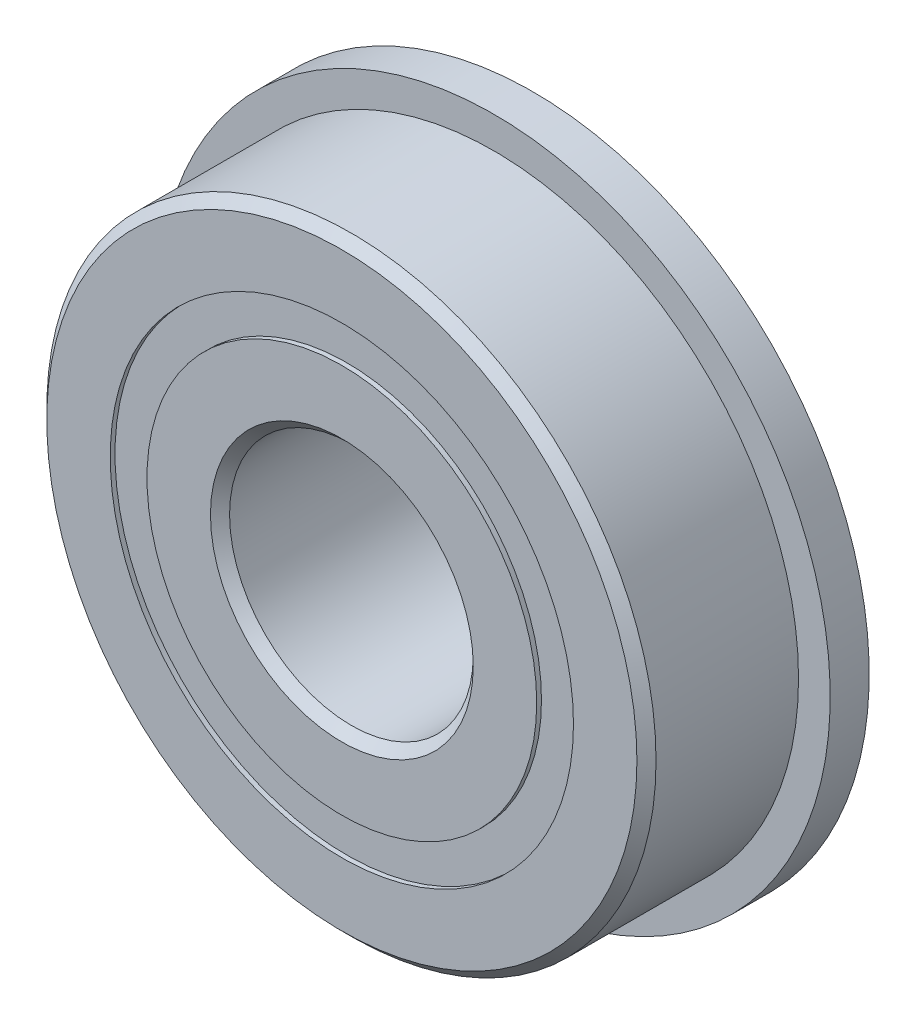
ISO-10303-21;
HEADER;
FILE_DESCRIPTION(('STEP AP214'),'2;1');
FILE_NAME('part.step','',(''),(''),'','','');
FILE_SCHEMA(('AUTOMOTIVE_DESIGN { 1 0 10303 214 1 1 1 1 }'));
ENDSEC;
DATA;
#1=APPLICATION_CONTEXT('core data for automotive mechanical design processes');
#2=APPLICATION_PROTOCOL_DEFINITION('international standard','automotive_design',2000,#1);
#3=PRODUCT_CONTEXT('',#1,'mechanical');
#4=PRODUCT('Part','Part','',(#3));
#5=PRODUCT_RELATED_PRODUCT_CATEGORY('part','',(#4));
#6=PRODUCT_DEFINITION_FORMATION('','',#4);
#7=PRODUCT_DEFINITION_CONTEXT('part definition',#1,'design');
#8=PRODUCT_DEFINITION('design','',#6,#7);
#9=PRODUCT_DEFINITION_SHAPE('','',#8);
#10=(LENGTH_UNIT() NAMED_UNIT(*) SI_UNIT(.MILLI.,.METRE.));
#11=(NAMED_UNIT(*) PLANE_ANGLE_UNIT() SI_UNIT($,.RADIAN.));
#12=(NAMED_UNIT(*) SI_UNIT($,.STERADIAN.) SOLID_ANGLE_UNIT());
#13=UNCERTAINTY_MEASURE_WITH_UNIT(LENGTH_MEASURE(1.E-05),#10,'distance_accuracy_value','');
#14=(GEOMETRIC_REPRESENTATION_CONTEXT(3) GLOBAL_UNCERTAINTY_ASSIGNED_CONTEXT((#13)) GLOBAL_UNIT_ASSIGNED_CONTEXT((#10,
#11,#12)) REPRESENTATION_CONTEXT('',''));
#15=CARTESIAN_POINT('',(0.,0.,0.));
#16=DIRECTION('',(0.,0.,1.));
#17=DIRECTION('',(1.,0.,0.));
#18=AXIS2_PLACEMENT_3D('',#15,#16,#17);
#19=CARTESIAN_POINT('',(0.,6.03522142857143,-2.36474));
#20=DIRECTION('',(0.,0.,1.));
#21=DIRECTION('',(1.,0.,0.));
#22=AXIS2_PLACEMENT_3D('',#19,#20,#21);
#23=PLANE('',#22);
#24=CARTESIAN_POINT('',(0.,0.,-2.36474));
#25=DIRECTION('',(0.,0.,1.));
#26=DIRECTION('',(1.,0.,0.));
#27=AXIS2_PLACEMENT_3D('',#24,#25,#26);
#28=CIRCLE('',#27,6.03522142857143);
#29=CARTESIAN_POINT('',(6.03522142857143,0.,-2.36474));
#30=VERTEX_POINT('',#29);
#31=EDGE_CURVE('E63',#30,#30,#28,.T.);
#32=ORIENTED_EDGE('',*,*,#31,.F.);
#33=EDGE_LOOP('',(#32));
#34=FACE_BOUND('',#33,.T.);
#35=CARTESIAN_POINT('',(0.,0.,-2.36474));
#36=DIRECTION('',(0.,0.,1.));
#37=DIRECTION('',(1.,0.,0.));
#38=AXIS2_PLACEMENT_3D('',#35,#36,#37);
#39=CIRCLE('',#38,5.07727857142857);
#40=CARTESIAN_POINT('',(5.07727857142857,0.,-2.36474));
#41=VERTEX_POINT('',#40);
#42=EDGE_CURVE('E11',#41,#41,#39,.T.);
#43=ORIENTED_EDGE('',*,*,#42,.T.);
#44=EDGE_LOOP('',(#43));
#45=FACE_BOUND('',#44,.T.);
#46=ADVANCED_FACE('F49',(#34,#45),#23,.F.);
#47=CARTESIAN_POINT('',(0.,0.,2.4892));
#48=DIRECTION('',(0.,0.,1.));
#49=DIRECTION('',(1.,0.,0.));
#50=AXIS2_PLACEMENT_3D('',#47,#48,#49);
#51=CYLINDRICAL_SURFACE('',#50,5.07727857142857);
#52=ORIENTED_EDGE('',*,*,#42,.F.);
#53=EDGE_LOOP('',(#52));
#54=FACE_BOUND('',#53,.T.);
#55=CARTESIAN_POINT('',(0.,0.,-1.20554465033679));
#56=DIRECTION('',(0.,0.,1.));
#57=DIRECTION('',(1.,0.,0.));
#58=AXIS2_PLACEMENT_3D('',#55,#56,#57);
#59=CIRCLE('',#58,5.07727857142857);
#60=CARTESIAN_POINT('',(5.07727857142857,0.,-1.20554465033679));
#61=VERTEX_POINT('',#60);
#62=EDGE_CURVE('E55',#61,#61,#59,.T.);
#63=ORIENTED_EDGE('',*,*,#62,.T.);
#64=EDGE_LOOP('',(#63));
#65=FACE_BOUND('',#64,.T.);
#66=ADVANCED_FACE('F72',(#54,#65),#51,.F.);
#67=CARTESIAN_POINT('',(0.,6.03522142857143,-1.20554465033679));
#68=DIRECTION('',(0.,0.,-1.));
#69=DIRECTION('',(-1.,0.,0.));
#70=AXIS2_PLACEMENT_3D('',#67,#68,#69);
#71=PLANE('',#70);
#72=ORIENTED_EDGE('',*,*,#62,.F.);
#73=EDGE_LOOP('',(#72));
#74=FACE_BOUND('',#73,.T.);
#75=CARTESIAN_POINT('',(0.,0.,-1.20554465033679));
#76=DIRECTION('',(0.,0.,1.));
#77=DIRECTION('',(1.,0.,0.));
#78=AXIS2_PLACEMENT_3D('',#75,#76,#77);
#79=CIRCLE('',#78,6.03522142857143);
#80=CARTESIAN_POINT('',(6.03522142857143,0.,-1.20554465033679));
#81=VERTEX_POINT('',#80);
#82=EDGE_CURVE('E59',#81,#81,#79,.T.);
#83=ORIENTED_EDGE('',*,*,#82,.T.);
#84=EDGE_LOOP('',(#83));
#85=FACE_BOUND('',#84,.T.);
#86=ADVANCED_FACE('F76',(#74,#85),#71,.F.);
#87=CARTESIAN_POINT('',(0.,0.,2.4892));
#88=DIRECTION('',(0.,0.,1.));
#89=DIRECTION('',(1.,0.,0.));
#90=AXIS2_PLACEMENT_3D('',#87,#88,#89);
#91=CYLINDRICAL_SURFACE('',#90,6.03522142857143);
#92=ORIENTED_EDGE('',*,*,#82,.F.);
#93=EDGE_LOOP('',(#92));
#94=FACE_BOUND('',#93,.T.);
#95=ORIENTED_EDGE('',*,*,#31,.T.);
#96=EDGE_LOOP('',(#95));
#97=FACE_BOUND('',#96,.T.);
#98=ADVANCED_FACE('F69',(#94,#97),#91,.T.);
#99=CLOSED_SHELL('',(#46,#66,#86,#98));
#100=MANIFOLD_SOLID_BREP('B2',#99);
#101=CARTESIAN_POINT('',(0.,6.03522142857143,2.36474));
#102=DIRECTION('',(0.,0.,-1.));
#103=DIRECTION('',(-1.,0.,0.));
#104=AXIS2_PLACEMENT_3D('',#101,#102,#103);
#105=PLANE('',#104);
#106=CARTESIAN_POINT('',(0.,0.,2.36474));
#107=DIRECTION('',(0.,0.,1.));
#108=DIRECTION('',(1.,0.,0.));
#109=AXIS2_PLACEMENT_3D('',#106,#107,#108);
#110=CIRCLE('',#109,5.07727857142857);
#111=CARTESIAN_POINT('',(5.07727857142857,0.,2.36474));
#112=VERTEX_POINT('',#111);
#113=EDGE_CURVE('E48',#112,#112,#110,.T.);
#114=ORIENTED_EDGE('',*,*,#113,.F.);
#115=EDGE_LOOP('',(#114));
#116=FACE_BOUND('',#115,.T.);
#117=CARTESIAN_POINT('',(0.,0.,2.36474));
#118=DIRECTION('',(0.,0.,1.));
#119=DIRECTION('',(1.,0.,0.));
#120=AXIS2_PLACEMENT_3D('',#117,#118,#119);
#121=CIRCLE('',#120,6.03522142857143);
#122=CARTESIAN_POINT('',(6.03522142857143,0.,2.36474));
#123=VERTEX_POINT('',#122);
#124=EDGE_CURVE('E130',#123,#123,#121,.T.);
#125=ORIENTED_EDGE('',*,*,#124,.T.);
#126=EDGE_LOOP('',(#125));
#127=FACE_BOUND('',#126,.T.);
#128=ADVANCED_FACE('F116',(#116,#127),#105,.F.);
#129=CARTESIAN_POINT('',(0.,0.,2.4892));
#130=DIRECTION('',(0.,0.,1.));
#131=DIRECTION('',(1.,0.,0.));
#132=AXIS2_PLACEMENT_3D('',#129,#130,#131);
#133=CYLINDRICAL_SURFACE('',#132,5.07727857142857);
#134=CARTESIAN_POINT('',(0.,0.,1.20554465033679));
#135=DIRECTION('',(0.,0.,1.));
#136=DIRECTION('',(1.,0.,0.));
#137=AXIS2_PLACEMENT_3D('',#134,#135,#136);
#138=CIRCLE('',#137,5.07727857142857);
#139=CARTESIAN_POINT('',(5.07727857142857,0.,1.20554465033679));
#140=VERTEX_POINT('',#139);
#141=EDGE_CURVE('E122',#140,#140,#138,.T.);
#142=ORIENTED_EDGE('',*,*,#141,.F.);
#143=EDGE_LOOP('',(#142));
#144=FACE_BOUND('',#143,.T.);
#145=ORIENTED_EDGE('',*,*,#113,.T.);
#146=EDGE_LOOP('',(#145));
#147=FACE_BOUND('',#146,.T.);
#148=ADVANCED_FACE('F145',(#144,#147),#133,.F.);
#149=CARTESIAN_POINT('',(0.,6.03522142857143,1.20554465033679));
#150=DIRECTION('',(0.,0.,1.));
#151=DIRECTION('',(1.,0.,0.));
#152=AXIS2_PLACEMENT_3D('',#149,#150,#151);
#153=PLANE('',#152);
#154=CARTESIAN_POINT('',(0.,0.,1.20554465033679));
#155=DIRECTION('',(0.,0.,1.));
#156=DIRECTION('',(1.,0.,0.));
#157=AXIS2_PLACEMENT_3D('',#154,#155,#156);
#158=CIRCLE('',#157,6.03522142857143);
#159=CARTESIAN_POINT('',(6.03522142857143,0.,1.20554465033679));
#160=VERTEX_POINT('',#159);
#161=EDGE_CURVE('E126',#160,#160,#158,.T.);
#162=ORIENTED_EDGE('',*,*,#161,.F.);
#163=EDGE_LOOP('',(#162));
#164=FACE_BOUND('',#163,.T.);
#165=ORIENTED_EDGE('',*,*,#141,.T.);
#166=EDGE_LOOP('',(#165));
#167=FACE_BOUND('',#166,.T.);
#168=ADVANCED_FACE('F140',(#164,#167),#153,.F.);
#169=CARTESIAN_POINT('',(0.,0.,2.4892));
#170=DIRECTION('',(0.,0.,1.));
#171=DIRECTION('',(1.,0.,0.));
#172=AXIS2_PLACEMENT_3D('',#169,#170,#171);
#173=CYLINDRICAL_SURFACE('',#172,6.03522142857143);
#174=ORIENTED_EDGE('',*,*,#124,.F.);
#175=EDGE_LOOP('',(#174));
#176=FACE_BOUND('',#175,.T.);
#177=ORIENTED_EDGE('',*,*,#161,.T.);
#178=EDGE_LOOP('',(#177));
#179=FACE_BOUND('',#178,.T.);
#180=ADVANCED_FACE('F137',(#176,#179),#173,.T.);
#181=CLOSED_SHELL('',(#128,#148,#168,#180));
#182=MANIFOLD_SOLID_BREP('B6',#181);
#183=CARTESIAN_POINT('',(-2.41076652547187,5.00600827228285,0.));
#184=DIRECTION('',(0.,0.,1.));
#185=DIRECTION('',(-0.433883739117546,0.900968867902425,0.));
#186=AXIS2_PLACEMENT_3D('',#183,#184,#185);
#187=SPHERICAL_SURFACE('',#186,1.20554465033679);
#188=CARTESIAN_POINT('',(-2.41076652547187,5.00600827228285,1.20554465033679));
#189=VERTEX_POINT('',#188);
#190=VERTEX_LOOP('',#189);
#191=FACE_BOUND('',#190,.T.);
#192=ADVANCED_FACE('F183',(#191),#187,.T.);
#193=CLOSED_SHELL('',(#192));
#194=MANIFOLD_SOLID_BREP('B43',#193);
#195=CARTESIAN_POINT('',(-4.34405117446295,3.46426521157764,0.));
#196=DIRECTION('',(0.,0.,1.));
#197=DIRECTION('',(-0.781831482468022,0.623489801858743,0.));
#198=AXIS2_PLACEMENT_3D('',#195,#196,#197);
#199=SPHERICAL_SURFACE('',#198,1.20554465033679);
#200=CARTESIAN_POINT('',(-4.34405117446295,3.46426521157764,1.20554465033679));
#201=VERTEX_POINT('',#200);
#202=VERTEX_LOOP('',#201);
#203=FACE_BOUND('',#202,.T.);
#204=ADVANCED_FACE('F203',(#203),#199,.T.);
#205=CLOSED_SHELL('',(#204));
#206=MANIFOLD_SOLID_BREP('B112',#205);
#207=CARTESIAN_POINT('',(-5.41694321206024,1.23638193929483,0.));
#208=DIRECTION('',(0.,0.,1.));
#209=DIRECTION('',(-0.974927912181821,0.222520933956325,0.));
#210=AXIS2_PLACEMENT_3D('',#207,#208,#209);
#211=SPHERICAL_SURFACE('',#210,1.20554465033679);
#212=CARTESIAN_POINT('',(-5.41694321206024,1.23638193929483,1.20554465033679));
#213=VERTEX_POINT('',#212);
#214=VERTEX_LOOP('',#213);
#215=FACE_BOUND('',#214,.T.);
#216=ADVANCED_FACE('F223',(#215),#211,.T.);
#217=CLOSED_SHELL('',(#216));
#218=MANIFOLD_SOLID_BREP('B179',#217);
#219=CARTESIAN_POINT('',(-5.41694321206027,-1.23638193929472,0.));
#220=DIRECTION('',(0.,0.,1.));
#221=DIRECTION('',(-0.974927912181826,-0.222520933956305,0.));
#222=AXIS2_PLACEMENT_3D('',#219,#220,#221);
#223=SPHERICAL_SURFACE('',#222,1.20554465033679);
#224=CARTESIAN_POINT('',(-5.41694321206027,-1.23638193929472,1.20554465033679));
#225=VERTEX_POINT('',#224);
#226=VERTEX_LOOP('',#225);
#227=FACE_BOUND('',#226,.T.);
#228=ADVANCED_FACE('F243',(#227),#223,.T.);
#229=CLOSED_SHELL('',(#228));
#230=MANIFOLD_SOLID_BREP('B199',#229);
#231=CARTESIAN_POINT('',(-4.34405117446302,-3.46426521157755,0.));
#232=DIRECTION('',(0.,0.,1.));
#233=DIRECTION('',(-0.781831482468035,-0.623489801858727,0.));
#234=AXIS2_PLACEMENT_3D('',#231,#232,#233);
#235=SPHERICAL_SURFACE('',#234,1.20554465033679);
#236=CARTESIAN_POINT('',(-4.34405117446302,-3.46426521157755,1.20554465033679));
#237=VERTEX_POINT('',#236);
#238=VERTEX_LOOP('',#237);
#239=FACE_BOUND('',#238,.T.);
#240=ADVANCED_FACE('F263',(#239),#235,.T.);
#241=CLOSED_SHELL('',(#240));
#242=MANIFOLD_SOLID_BREP('B219',#241);
#243=CARTESIAN_POINT('',(-2.41076652547197,-5.0060082722828,0.));
#244=DIRECTION('',(0.,0.,1.));
#245=DIRECTION('',(-0.433883739117565,-0.900968867902416,0.));
#246=AXIS2_PLACEMENT_3D('',#243,#244,#245);
#247=SPHERICAL_SURFACE('',#246,1.20554465033679);
#248=CARTESIAN_POINT('',(-2.41076652547197,-5.0060082722828,1.20554465033679));
#249=VERTEX_POINT('',#248);
#250=VERTEX_LOOP('',#249);
#251=FACE_BOUND('',#250,.T.);
#252=ADVANCED_FACE('F283',(#251),#247,.T.);
#253=CLOSED_SHELL('',(#252));
#254=MANIFOLD_SOLID_BREP('B239',#253);
#255=CARTESIAN_POINT('',(0.,-5.55625,0.));
#256=DIRECTION('',(0.,0.,1.));
#257=DIRECTION('',(0.,-1.,0.));
#258=AXIS2_PLACEMENT_3D('',#255,#256,#257);
#259=SPHERICAL_SURFACE('',#258,1.20554465033679);
#260=CARTESIAN_POINT('',(0.,-5.55625,1.20554465033679));
#261=VERTEX_POINT('',#260);
#262=VERTEX_LOOP('',#261);
#263=FACE_BOUND('',#262,.T.);
#264=ADVANCED_FACE('F303',(#263),#259,.T.);
#265=CLOSED_SHELL('',(#264));
#266=MANIFOLD_SOLID_BREP('B259',#265);
#267=CARTESIAN_POINT('',(2.4107665254719,-5.00600827228283,0.));
#268=DIRECTION('',(0.,0.,1.));
#269=DIRECTION('',(0.433883739117553,-0.900968867902422,0.));
#270=AXIS2_PLACEMENT_3D('',#267,#268,#269);
#271=SPHERICAL_SURFACE('',#270,1.20554465033679);
#272=CARTESIAN_POINT('',(2.4107665254719,-5.00600827228283,1.20554465033679));
#273=VERTEX_POINT('',#272);
#274=VERTEX_LOOP('',#273);
#275=FACE_BOUND('',#274,.T.);
#276=ADVANCED_FACE('F323',(#275),#271,.T.);
#277=CLOSED_SHELL('',(#276));
#278=MANIFOLD_SOLID_BREP('B279',#277);
#279=CARTESIAN_POINT('',(4.34405117446297,-3.46426521157761,0.));
#280=DIRECTION('',(0.,0.,1.));
#281=DIRECTION('',(0.781831482468027,-0.623489801858737,0.));
#282=AXIS2_PLACEMENT_3D('',#279,#280,#281);
#283=SPHERICAL_SURFACE('',#282,1.20554465033679);
#284=CARTESIAN_POINT('',(4.34405117446297,-3.46426521157761,1.20554465033679));
#285=VERTEX_POINT('',#284);
#286=VERTEX_LOOP('',#285);
#287=FACE_BOUND('',#286,.T.);
#288=ADVANCED_FACE('F343',(#287),#283,.T.);
#289=CLOSED_SHELL('',(#288));
#290=MANIFOLD_SOLID_BREP('B299',#289);
#291=CARTESIAN_POINT('',(5.41694321206025,-1.23638193929479,0.));
#292=DIRECTION('',(0.,0.,1.));
#293=DIRECTION('',(0.974927912181823,-0.222520933956318,0.));
#294=AXIS2_PLACEMENT_3D('',#291,#292,#293);
#295=SPHERICAL_SURFACE('',#294,1.20554465033679);
#296=CARTESIAN_POINT('',(5.41694321206025,-1.23638193929479,1.20554465033679));
#297=VERTEX_POINT('',#296);
#298=VERTEX_LOOP('',#297);
#299=FACE_BOUND('',#298,.T.);
#300=ADVANCED_FACE('F363',(#299),#295,.T.);
#301=CLOSED_SHELL('',(#300));
#302=MANIFOLD_SOLID_BREP('B319',#301);
#303=CARTESIAN_POINT('',(5.41694321206026,1.23638193929476,0.));
#304=DIRECTION('',(0.,0.,1.));
#305=DIRECTION('',(0.974927912181824,0.222520933956311,0.));
#306=AXIS2_PLACEMENT_3D('',#303,#304,#305);
#307=SPHERICAL_SURFACE('',#306,1.20554465033679);
#308=CARTESIAN_POINT('',(5.41694321206026,1.23638193929476,1.20554465033679));
#309=VERTEX_POINT('',#308);
#310=VERTEX_LOOP('',#309);
#311=FACE_BOUND('',#310,.T.);
#312=ADVANCED_FACE('F383',(#311),#307,.T.);
#313=CLOSED_SHELL('',(#312));
#314=MANIFOLD_SOLID_BREP('B339',#313);
#315=CARTESIAN_POINT('',(4.344051174463,3.46426521157758,0.));
#316=DIRECTION('',(0.,0.,1.));
#317=DIRECTION('',(0.781831482468031,0.623489801858732,0.));
#318=AXIS2_PLACEMENT_3D('',#315,#316,#317);
#319=SPHERICAL_SURFACE('',#318,1.20554465033679);
#320=CARTESIAN_POINT('',(4.344051174463,3.46426521157758,1.20554465033679));
#321=VERTEX_POINT('',#320);
#322=VERTEX_LOOP('',#321);
#323=FACE_BOUND('',#322,.T.);
#324=ADVANCED_FACE('F403',(#323),#319,.T.);
#325=CLOSED_SHELL('',(#324));
#326=MANIFOLD_SOLID_BREP('B359',#325);
#327=CARTESIAN_POINT('',(2.41076652547194,5.00600827228281,0.));
#328=DIRECTION('',(0.,0.,1.));
#329=DIRECTION('',(0.433883739117559,0.900968867902419,0.));
#330=AXIS2_PLACEMENT_3D('',#327,#328,#329);
#331=SPHERICAL_SURFACE('',#330,1.20554465033679);
#332=CARTESIAN_POINT('',(2.41076652547194,5.00600827228281,1.20554465033679));
#333=VERTEX_POINT('',#332);
#334=VERTEX_LOOP('',#333);
#335=FACE_BOUND('',#334,.T.);
#336=ADVANCED_FACE('F423',(#335),#331,.T.);
#337=CLOSED_SHELL('',(#336));
#338=MANIFOLD_SOLID_BREP('B379',#337);
#339=CARTESIAN_POINT('',(0.,5.55625,0.));
#340=DIRECTION('',(0.,0.,1.));
#341=DIRECTION('',(0.,1.,0.));
#342=AXIS2_PLACEMENT_3D('',#339,#340,#341);
#343=SPHERICAL_SURFACE('',#342,1.20554465033679);
#344=CARTESIAN_POINT('',(0.,5.55625,1.20554465033679));
#345=VERTEX_POINT('',#344);
#346=VERTEX_LOOP('',#345);
#347=FACE_BOUND('',#346,.T.);
#348=ADVANCED_FACE('F445',(#347),#343,.T.);
#349=CLOSED_SHELL('',(#348));
#350=MANIFOLD_SOLID_BREP('B399',#349);
#351=CARTESIAN_POINT('',(0.,5.07727857142857,2.4892));
#352=DIRECTION('',(0.,0.,-1.));
#353=DIRECTION('',(-1.,0.,0.));
#354=AXIS2_PLACEMENT_3D('',#351,#352,#353);
#355=PLANE('',#354);
#356=CARTESIAN_POINT('',(0.,0.,2.4892));
#357=DIRECTION('',(0.,0.,1.));
#358=DIRECTION('',(1.,0.,0.));
#359=AXIS2_PLACEMENT_3D('',#356,#357,#358);
#360=CIRCLE('',#359,3.42392);
#361=CARTESIAN_POINT('',(3.42392,0.,2.4892));
#362=VERTEX_POINT('',#361);
#363=EDGE_CURVE('E492',#362,#362,#360,.T.);
#364=ORIENTED_EDGE('',*,*,#363,.F.);
#365=EDGE_LOOP('',(#364));
#366=FACE_BOUND('',#365,.T.);
#367=CARTESIAN_POINT('',(0.,0.,2.4892));
#368=DIRECTION('',(0.,0.,1.));
#369=DIRECTION('',(1.,0.,0.));
#370=AXIS2_PLACEMENT_3D('',#367,#368,#369);
#371=CIRCLE('',#370,5.07727857142857);
#372=CARTESIAN_POINT('',(5.07727857142857,0.,2.4892));
#373=VERTEX_POINT('',#372);
#374=EDGE_CURVE('E444',#373,#373,#371,.T.);
#375=ORIENTED_EDGE('',*,*,#374,.T.);
#376=EDGE_LOOP('',(#375));
#377=FACE_BOUND('',#376,.T.);
#378=ADVANCED_FACE('F464',(#366,#377),#355,.F.);
#379=CARTESIAN_POINT('',(0.,0.,2.4892));
#380=DIRECTION('',(0.,0.,1.));
#381=DIRECTION('',(1.,0.,0.));
#382=AXIS2_PLACEMENT_3D('',#379,#380,#381);
#383=CYLINDRICAL_SURFACE('',#382,5.07727857142857);
#384=ORIENTED_EDGE('',*,*,#374,.F.);
#385=EDGE_LOOP('',(#384));
#386=FACE_BOUND('',#385,.T.);
#387=CARTESIAN_POINT('',(0.,0.,1.10631111111111));
#388=DIRECTION('',(0.,0.,1.));
#389=DIRECTION('',(1.,0.,0.));
#390=AXIS2_PLACEMENT_3D('',#387,#388,#389);
#391=CIRCLE('',#390,5.07727857142857);
#392=CARTESIAN_POINT('',(5.07727857142857,0.,1.10631111111111));
#393=VERTEX_POINT('',#392);
#394=EDGE_CURVE('E470',#393,#393,#391,.T.);
#395=ORIENTED_EDGE('',*,*,#394,.T.);
#396=EDGE_LOOP('',(#395));
#397=FACE_BOUND('',#396,.T.);
#398=ADVANCED_FACE('F499',(#386,#397),#383,.T.);
#399=CARTESIAN_POINT('',(0.,0.,0.));
#400=DIRECTION('',(0.,0.,1.));
#401=DIRECTION('',(1.,0.,0.));
#402=AXIS2_PLACEMENT_3D('',#399,#400,#401);
#403=TOROIDAL_SURFACE('',#402,5.55625,1.20554465033679);
#404=ORIENTED_EDGE('',*,*,#394,.F.);
#405=EDGE_LOOP('',(#404));
#406=FACE_BOUND('',#405,.T.);
#407=CARTESIAN_POINT('',(0.,0.,-1.10631111111111));
#408=DIRECTION('',(0.,0.,1.));
#409=DIRECTION('',(1.,0.,0.));
#410=AXIS2_PLACEMENT_3D('',#407,#408,#409);
#411=CIRCLE('',#410,5.07727857142857);
#412=CARTESIAN_POINT('',(5.07727857142857,0.,-1.10631111111111));
#413=VERTEX_POINT('',#412);
#414=EDGE_CURVE('E474',#413,#413,#411,.T.);
#415=ORIENTED_EDGE('',*,*,#414,.T.);
#416=EDGE_LOOP('',(#415));
#417=FACE_BOUND('',#416,.T.);
#418=ADVANCED_FACE('F503',(#406,#417),#403,.F.);
#419=CARTESIAN_POINT('',(0.,0.,2.4892));
#420=DIRECTION('',(0.,0.,1.));
#421=DIRECTION('',(1.,0.,0.));
#422=AXIS2_PLACEMENT_3D('',#419,#420,#421);
#423=CYLINDRICAL_SURFACE('',#422,5.07727857142857);
#424=ORIENTED_EDGE('',*,*,#414,.F.);
#425=EDGE_LOOP('',(#424));
#426=FACE_BOUND('',#425,.T.);
#427=CARTESIAN_POINT('',(0.,0.,-2.4892));
#428=DIRECTION('',(0.,0.,1.));
#429=DIRECTION('',(1.,0.,0.));
#430=AXIS2_PLACEMENT_3D('',#427,#428,#429);
#431=CIRCLE('',#430,5.07727857142857);
#432=CARTESIAN_POINT('',(5.07727857142857,0.,-2.4892));
#433=VERTEX_POINT('',#432);
#434=EDGE_CURVE('E478',#433,#433,#431,.T.);
#435=ORIENTED_EDGE('',*,*,#434,.T.);
#436=EDGE_LOOP('',(#435));
#437=FACE_BOUND('',#436,.T.);
#438=ADVANCED_FACE('F508',(#426,#437),#423,.T.);
#439=CARTESIAN_POINT('',(0.,3.42392,-2.4892));
#440=DIRECTION('',(0.,0.,1.));
#441=DIRECTION('',(1.,0.,0.));
#442=AXIS2_PLACEMENT_3D('',#439,#440,#441);
#443=PLANE('',#442);
#444=ORIENTED_EDGE('',*,*,#434,.F.);
#445=EDGE_LOOP('',(#444));
#446=FACE_BOUND('',#445,.T.);
#447=CARTESIAN_POINT('',(0.,0.,-2.4892));
#448=DIRECTION('',(0.,0.,1.));
#449=DIRECTION('',(1.,0.,0.));
#450=AXIS2_PLACEMENT_3D('',#447,#448,#449);
#451=CIRCLE('',#450,3.42392);
#452=CARTESIAN_POINT('',(3.42392,0.,-2.4892));
#453=VERTEX_POINT('',#452);
#454=EDGE_CURVE('E483',#453,#453,#451,.T.);
#455=ORIENTED_EDGE('',*,*,#454,.T.);
#456=EDGE_LOOP('',(#455));
#457=FACE_BOUND('',#456,.T.);
#458=ADVANCED_FACE('F514',(#446,#457),#443,.F.);
#459=CARTESIAN_POINT('',(0.,0.,-2.24028));
#460=DIRECTION('',(0.,0.,-1.));
#461=DIRECTION('',(-1.,0.,0.));
#462=AXIS2_PLACEMENT_3D('',#459,#460,#461);
#463=CONICAL_SURFACE('',#462,3.175,0.785398163397448);
#464=ORIENTED_EDGE('',*,*,#454,.F.);
#465=EDGE_LOOP('',(#464));
#466=FACE_BOUND('',#465,.T.);
#467=CARTESIAN_POINT('',(0.,0.,-2.24028));
#468=DIRECTION('',(0.,0.,1.));
#469=DIRECTION('',(1.,0.,0.));
#470=AXIS2_PLACEMENT_3D('',#467,#468,#469);
#471=CIRCLE('',#470,3.175);
#472=CARTESIAN_POINT('',(3.175,0.,-2.24028));
#473=VERTEX_POINT('',#472);
#474=EDGE_CURVE('E486',#473,#473,#471,.T.);
#475=ORIENTED_EDGE('',*,*,#474,.T.);
#476=EDGE_LOOP('',(#475));
#477=FACE_BOUND('',#476,.T.);
#478=ADVANCED_FACE('F518',(#466,#477),#463,.F.);
#479=CARTESIAN_POINT('',(0.,0.,2.4892));
#480=DIRECTION('',(0.,0.,1.));
#481=DIRECTION('',(1.,0.,0.));
#482=AXIS2_PLACEMENT_3D('',#479,#480,#481);
#483=CYLINDRICAL_SURFACE('',#482,3.175);
#484=ORIENTED_EDGE('',*,*,#474,.F.);
#485=EDGE_LOOP('',(#484));
#486=FACE_BOUND('',#485,.T.);
#487=CARTESIAN_POINT('',(0.,0.,2.24028));
#488=DIRECTION('',(0.,0.,1.));
#489=DIRECTION('',(1.,0.,0.));
#490=AXIS2_PLACEMENT_3D('',#487,#488,#489);
#491=CIRCLE('',#490,3.175);
#492=CARTESIAN_POINT('',(3.175,0.,2.24028));
#493=VERTEX_POINT('',#492);
#494=EDGE_CURVE('E489',#493,#493,#491,.T.);
#495=ORIENTED_EDGE('',*,*,#494,.T.);
#496=EDGE_LOOP('',(#495));
#497=FACE_BOUND('',#496,.T.);
#498=ADVANCED_FACE('F522',(#486,#497),#483,.F.);
#499=CARTESIAN_POINT('',(0.,0.,2.4892));
#500=DIRECTION('',(0.,0.,1.));
#501=DIRECTION('',(1.,0.,0.));
#502=AXIS2_PLACEMENT_3D('',#499,#500,#501);
#503=CONICAL_SURFACE('',#502,3.42392,0.785398163397448);
#504=ORIENTED_EDGE('',*,*,#494,.F.);
#505=EDGE_LOOP('',(#504));
#506=FACE_BOUND('',#505,.T.);
#507=ORIENTED_EDGE('',*,*,#363,.T.);
#508=EDGE_LOOP('',(#507));
#509=FACE_BOUND('',#508,.T.);
#510=ADVANCED_FACE('F496',(#506,#509),#503,.F.);
#511=CLOSED_SHELL('',(#378,#398,#418,#438,#458,#478,#498,#510));
#512=MANIFOLD_SOLID_BREP('B419',#511);
#513=CARTESIAN_POINT('',(0.,0.,2.24028));
#514=DIRECTION('',(0.,0.,-1.));
#515=DIRECTION('',(-1.,0.,0.));
#516=AXIS2_PLACEMENT_3D('',#513,#514,#515);
#517=CONICAL_SURFACE('',#516,7.9375,0.785398163397447);
#518=CARTESIAN_POINT('',(0.,0.,2.4892));
#519=DIRECTION('',(0.,0.,1.));
#520=DIRECTION('',(1.,0.,0.));
#521=AXIS2_PLACEMENT_3D('',#518,#519,#520);
#522=CIRCLE('',#521,7.68858);
#523=CARTESIAN_POINT('',(7.68858,0.,2.4892));
#524=VERTEX_POINT('',#523);
#525=EDGE_CURVE('E612',#524,#524,#522,.T.);
#526=ORIENTED_EDGE('',*,*,#525,.F.);
#527=EDGE_LOOP('',(#526));
#528=FACE_BOUND('',#527,.T.);
#529=CARTESIAN_POINT('',(0.,0.,2.24028));
#530=DIRECTION('',(0.,0.,1.));
#531=DIRECTION('',(1.,0.,0.));
#532=AXIS2_PLACEMENT_3D('',#529,#530,#531);
#533=CIRCLE('',#532,7.9375);
#534=CARTESIAN_POINT('',(7.9375,0.,2.24028));
#535=VERTEX_POINT('',#534);
#536=EDGE_CURVE('E463',#535,#535,#533,.T.);
#537=ORIENTED_EDGE('',*,*,#536,.T.);
#538=EDGE_LOOP('',(#537));
#539=FACE_BOUND('',#538,.T.);
#540=ADVANCED_FACE('F585',(#528,#539),#517,.T.);
#541=CARTESIAN_POINT('',(0.,0.,2.4892));
#542=DIRECTION('',(0.,0.,1.));
#543=DIRECTION('',(1.,0.,0.));
#544=AXIS2_PLACEMENT_3D('',#541,#542,#543);
#545=CYLINDRICAL_SURFACE('',#544,7.9375);
#546=CARTESIAN_POINT('',(0.,0.,-1.4732));
#547=DIRECTION('',(0.,0.,1.));
#548=DIRECTION('',(1.,0.,0.));
#549=AXIS2_PLACEMENT_3D('',#546,#547,#548);
#550=CIRCLE('',#549,7.9375);
#551=CARTESIAN_POINT('',(7.9375,0.,-1.4732));
#552=VERTEX_POINT('',#551);
#553=EDGE_CURVE('E616',#552,#552,#550,.T.);
#554=ORIENTED_EDGE('',*,*,#553,.T.);
#555=EDGE_LOOP('',(#554));
#556=FACE_BOUND('',#555,.T.);
#557=ORIENTED_EDGE('',*,*,#536,.F.);
#558=EDGE_LOOP('',(#557));
#559=FACE_BOUND('',#558,.T.);
#560=ADVANCED_FACE('F639',(#556,#559),#545,.T.);
#561=CARTESIAN_POINT('',(0.,7.68858,-2.4892));
#562=DIRECTION('',(0.,0.,1.));
#563=DIRECTION('',(1.,0.,0.));
#564=AXIS2_PLACEMENT_3D('',#561,#562,#563);
#565=PLANE('',#564);
#566=CARTESIAN_POINT('',(0.,0.,-2.4892));
#567=DIRECTION('',(0.,0.,1.));
#568=DIRECTION('',(1.,0.,0.));
#569=AXIS2_PLACEMENT_3D('',#566,#567,#568);
#570=CIRCLE('',#569,6.03522142857143);
#571=CARTESIAN_POINT('',(6.03522142857143,0.,-2.4892));
#572=VERTEX_POINT('',#571);
#573=EDGE_CURVE('E592',#572,#572,#570,.T.);
#574=ORIENTED_EDGE('',*,*,#573,.T.);
#575=EDGE_LOOP('',(#574));
#576=FACE_BOUND('',#575,.T.);
#577=CARTESIAN_POINT('',(0.,0.,-2.4892));
#578=DIRECTION('',(0.,0.,-1.));
#579=DIRECTION('',(-1.,0.,0.));
#580=AXIS2_PLACEMENT_3D('',#577,#578,#579);
#581=CIRCLE('',#580,8.763);
#582=CARTESIAN_POINT('',(-8.763,0.,-2.4892));
#583=VERTEX_POINT('',#582);
#584=EDGE_CURVE('E620',#583,#583,#581,.T.);
#585=ORIENTED_EDGE('',*,*,#584,.T.);
#586=EDGE_LOOP('',(#585));
#587=FACE_BOUND('',#586,.T.);
#588=ADVANCED_FACE('F642',(#576,#587),#565,.F.);
#589=CARTESIAN_POINT('',(0.,0.,2.4892));
#590=DIRECTION('',(0.,0.,1.));
#591=DIRECTION('',(1.,0.,0.));
#592=AXIS2_PLACEMENT_3D('',#589,#590,#591);
#593=CYLINDRICAL_SURFACE('',#592,6.03522142857143);
#594=CARTESIAN_POINT('',(0.,0.,-1.10631111111111));
#595=DIRECTION('',(0.,0.,1.));
#596=DIRECTION('',(1.,0.,0.));
#597=AXIS2_PLACEMENT_3D('',#594,#595,#596);
#598=CIRCLE('',#597,6.03522142857143);
#599=CARTESIAN_POINT('',(6.03522142857143,0.,-1.10631111111111));
#600=VERTEX_POINT('',#599);
#601=EDGE_CURVE('E597',#600,#600,#598,.T.);
#602=ORIENTED_EDGE('',*,*,#601,.T.);
#603=EDGE_LOOP('',(#602));
#604=FACE_BOUND('',#603,.T.);
#605=ORIENTED_EDGE('',*,*,#573,.F.);
#606=EDGE_LOOP('',(#605));
#607=FACE_BOUND('',#606,.T.);
#608=ADVANCED_FACE('F647',(#604,#607),#593,.F.);
#609=CARTESIAN_POINT('',(0.,0.,0.));
#610=DIRECTION('',(0.,0.,1.));
#611=DIRECTION('',(1.,0.,0.));
#612=AXIS2_PLACEMENT_3D('',#609,#610,#611);
#613=TOROIDAL_SURFACE('',#612,5.55625,1.20554465033679);
#614=ORIENTED_EDGE('',*,*,#601,.F.);
#615=EDGE_LOOP('',(#614));
#616=FACE_BOUND('',#615,.T.);
#617=CARTESIAN_POINT('',(0.,0.,1.10631111111111));
#618=DIRECTION('',(0.,0.,1.));
#619=DIRECTION('',(1.,0.,0.));
#620=AXIS2_PLACEMENT_3D('',#617,#618,#619);
#621=CIRCLE('',#620,6.03522142857143);
#622=CARTESIAN_POINT('',(6.03522142857143,0.,1.10631111111111));
#623=VERTEX_POINT('',#622);
#624=EDGE_CURVE('E602',#623,#623,#621,.T.);
#625=ORIENTED_EDGE('',*,*,#624,.T.);
#626=EDGE_LOOP('',(#625));
#627=FACE_BOUND('',#626,.T.);
#628=ADVANCED_FACE('F653',(#616,#627),#613,.F.);
#629=CARTESIAN_POINT('',(0.,0.,2.4892));
#630=DIRECTION('',(0.,0.,1.));
#631=DIRECTION('',(1.,0.,0.));
#632=AXIS2_PLACEMENT_3D('',#629,#630,#631);
#633=CYLINDRICAL_SURFACE('',#632,6.03522142857143);
#634=ORIENTED_EDGE('',*,*,#624,.F.);
#635=EDGE_LOOP('',(#634));
#636=FACE_BOUND('',#635,.T.);
#637=CARTESIAN_POINT('',(0.,0.,2.4892));
#638=DIRECTION('',(0.,0.,1.));
#639=DIRECTION('',(1.,0.,0.));
#640=AXIS2_PLACEMENT_3D('',#637,#638,#639);
#641=CIRCLE('',#640,6.03522142857143);
#642=CARTESIAN_POINT('',(6.03522142857143,0.,2.4892));
#643=VERTEX_POINT('',#642);
#644=EDGE_CURVE('E608',#643,#643,#641,.T.);
#645=ORIENTED_EDGE('',*,*,#644,.T.);
#646=EDGE_LOOP('',(#645));
#647=FACE_BOUND('',#646,.T.);
#648=ADVANCED_FACE('F657',(#636,#647),#633,.F.);
#649=CARTESIAN_POINT('',(0.,7.68858,2.4892));
#650=DIRECTION('',(0.,0.,-1.));
#651=DIRECTION('',(-1.,0.,0.));
#652=AXIS2_PLACEMENT_3D('',#649,#650,#651);
#653=PLANE('',#652);
#654=ORIENTED_EDGE('',*,*,#644,.F.);
#655=EDGE_LOOP('',(#654));
#656=FACE_BOUND('',#655,.T.);
#657=ORIENTED_EDGE('',*,*,#525,.T.);
#658=EDGE_LOOP('',(#657));
#659=FACE_BOUND('',#658,.T.);
#660=ADVANCED_FACE('F635',(#656,#659),#653,.F.);
#661=CARTESIAN_POINT('',(0.,6.03522142857143,-1.4732));
#662=DIRECTION('',(0.,0.,1.));
#663=DIRECTION('',(1.,0.,0.));
#664=AXIS2_PLACEMENT_3D('',#661,#662,#663);
#665=PLANE('',#664);
#666=CARTESIAN_POINT('',(0.,0.,-1.4732));
#667=DIRECTION('',(0.,0.,-1.));
#668=DIRECTION('',(-1.,0.,0.));
#669=AXIS2_PLACEMENT_3D('',#666,#667,#668);
#670=CIRCLE('',#669,8.763);
#671=CARTESIAN_POINT('',(-8.763,0.,-1.4732));
#672=VERTEX_POINT('',#671);
#673=EDGE_CURVE('E624',#672,#672,#670,.T.);
#674=ORIENTED_EDGE('',*,*,#673,.F.);
#675=EDGE_LOOP('',(#674));
#676=FACE_BOUND('',#675,.T.);
#677=ORIENTED_EDGE('',*,*,#553,.F.);
#678=EDGE_LOOP('',(#677));
#679=FACE_BOUND('',#678,.T.);
#680=ADVANCED_FACE('F632',(#676,#679),#665,.T.);
#681=CARTESIAN_POINT('',(0.,0.,-2.4892));
#682=DIRECTION('',(0.,0.,-1.));
#683=DIRECTION('',(-1.,0.,0.));
#684=AXIS2_PLACEMENT_3D('',#681,#682,#683);
#685=CYLINDRICAL_SURFACE('',#684,8.763);
#686=ORIENTED_EDGE('',*,*,#673,.T.);
#687=EDGE_LOOP('',(#686));
#688=FACE_BOUND('',#687,.T.);
#689=ORIENTED_EDGE('',*,*,#584,.F.);
#690=EDGE_LOOP('',(#689));
#691=FACE_BOUND('',#690,.T.);
#692=ADVANCED_FACE('F629',(#688,#691),#685,.T.);
#693=CLOSED_SHELL('',(#540,#560,#588,#608,#628,#648,#660,#680,#692));
#694=MANIFOLD_SOLID_BREP('B439',#693);
#695=ADVANCED_BREP_SHAPE_REPRESENTATION('',(#18,#100,#182,#194,#206,#218,#230,#242,#254,#266,
#278,#290,#302,#314,#326,#338,#350,#512,#694),#14);
#696=SHAPE_DEFINITION_REPRESENTATION(#9,#695);
ENDSEC;
END-ISO-10303-21;
